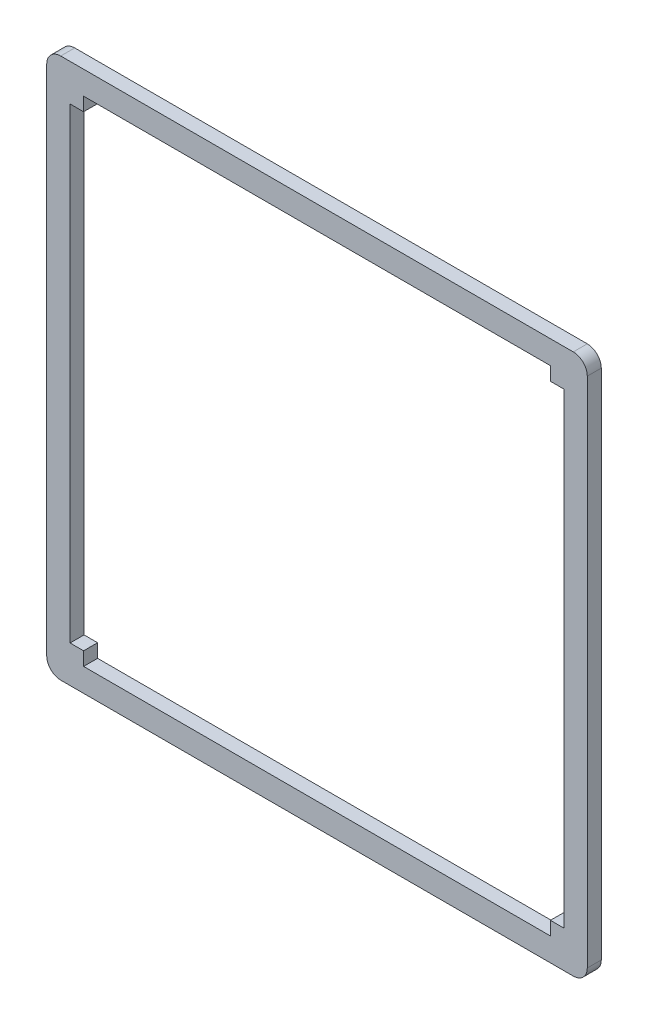
ISO-10303-21;
HEADER;
FILE_DESCRIPTION(('STEP AP214'),'2;1');
FILE_NAME('part.step','',(''),(''),'','','');
FILE_SCHEMA(('AUTOMOTIVE_DESIGN { 1 0 10303 214 1 1 1 1 }'));
ENDSEC;
DATA;
#1=APPLICATION_CONTEXT('core data for automotive mechanical design processes');
#2=APPLICATION_PROTOCOL_DEFINITION('international standard','automotive_design',2000,#1);
#3=PRODUCT_CONTEXT('',#1,'mechanical');
#4=PRODUCT('Part','Part','',(#3));
#5=PRODUCT_RELATED_PRODUCT_CATEGORY('part','',(#4));
#6=PRODUCT_DEFINITION_FORMATION('','',#4);
#7=PRODUCT_DEFINITION_CONTEXT('part definition',#1,'design');
#8=PRODUCT_DEFINITION('design','',#6,#7);
#9=PRODUCT_DEFINITION_SHAPE('','',#8);
#10=(LENGTH_UNIT() NAMED_UNIT(*) SI_UNIT(.MILLI.,.METRE.));
#11=(NAMED_UNIT(*) PLANE_ANGLE_UNIT() SI_UNIT($,.RADIAN.));
#12=(NAMED_UNIT(*) SI_UNIT($,.STERADIAN.) SOLID_ANGLE_UNIT());
#13=UNCERTAINTY_MEASURE_WITH_UNIT(LENGTH_MEASURE(1.E-05),#10,'distance_accuracy_value','');
#14=(GEOMETRIC_REPRESENTATION_CONTEXT(3) GLOBAL_UNCERTAINTY_ASSIGNED_CONTEXT((#13)) GLOBAL_UNIT_ASSIGNED_CONTEXT((#10,
#11,#12)) REPRESENTATION_CONTEXT('',''));
#15=CARTESIAN_POINT('',(0.,0.,0.));
#16=DIRECTION('',(0.,0.,1.));
#17=DIRECTION('',(1.,0.,0.));
#18=AXIS2_PLACEMENT_3D('',#15,#16,#17);
#19=CARTESIAN_POINT('',(107.9,0.,3.));
#20=DIRECTION('',(1.,0.,0.));
#21=DIRECTION('',(0.,0.,-1.));
#22=AXIS2_PLACEMENT_3D('',#19,#20,#21);
#23=PLANE('',#22);
#24=DIRECTION('',(0.,-1.,0.));
#25=VECTOR('',#24,1.);
#26=CARTESIAN_POINT('',(107.9,0.,0.));
#27=LINE('',#26,#25);
#28=CARTESIAN_POINT('',(107.9,104.9,0.));
#29=VERTEX_POINT('',#28);
#30=CARTESIAN_POINT('',(107.9,-4.9,0.));
#31=VERTEX_POINT('',#30);
#32=EDGE_CURVE('E240',#29,#31,#27,.T.);
#33=ORIENTED_EDGE('',*,*,#32,.F.);
#34=DIRECTION('',(0.,0.,-1.));
#35=VECTOR('',#34,1.);
#36=CARTESIAN_POINT('',(107.9,104.9,3.));
#37=LINE('',#36,#35);
#38=CARTESIAN_POINT('',(107.9,104.9,3.));
#39=VERTEX_POINT('',#38);
#40=EDGE_CURVE('E11',#39,#29,#37,.T.);
#41=ORIENTED_EDGE('',*,*,#40,.F.);
#42=DIRECTION('',(0.,-1.,0.));
#43=VECTOR('',#42,1.);
#44=CARTESIAN_POINT('',(107.9,0.,3.));
#45=LINE('',#44,#43);
#46=CARTESIAN_POINT('',(107.9,-4.9,3.));
#47=VERTEX_POINT('',#46);
#48=EDGE_CURVE('E473',#39,#47,#45,.T.);
#49=ORIENTED_EDGE('',*,*,#48,.T.);
#50=DIRECTION('',(0.,0.,-1.));
#51=VECTOR('',#50,1.);
#52=CARTESIAN_POINT('',(107.9,-4.9,3.));
#53=LINE('',#52,#51);
#54=EDGE_CURVE('E121',#47,#31,#53,.T.);
#55=ORIENTED_EDGE('',*,*,#54,.T.);
#56=EDGE_LOOP('',(#33,#41,#49,#55));
#57=FACE_BOUND('',#56,.T.);
#58=ADVANCED_FACE('F31',(#57),#23,.T.);
#59=CARTESIAN_POINT('',(104.9,104.9,3.));
#60=DIRECTION('',(0.,0.,-1.));
#61=DIRECTION('',(-1.,0.,0.));
#62=AXIS2_PLACEMENT_3D('',#59,#60,#61);
#63=CYLINDRICAL_SURFACE('',#62,3.00000000000001);
#64=CARTESIAN_POINT('',(104.9,104.9,0.));
#65=DIRECTION('',(0.,0.,1.));
#66=DIRECTION('',(1.,0.,0.));
#67=AXIS2_PLACEMENT_3D('',#64,#65,#66);
#68=CIRCLE('',#67,3.00000000000001);
#69=CARTESIAN_POINT('',(104.9,107.9,0.));
#70=VERTEX_POINT('',#69);
#71=EDGE_CURVE('E242',#29,#70,#68,.T.);
#72=ORIENTED_EDGE('',*,*,#71,.T.);
#73=DIRECTION('',(0.,0.,-1.));
#74=VECTOR('',#73,1.);
#75=CARTESIAN_POINT('',(104.9,107.9,3.));
#76=LINE('',#75,#74);
#77=CARTESIAN_POINT('',(104.9,107.9,3.));
#78=VERTEX_POINT('',#77);
#79=EDGE_CURVE('E41',#78,#70,#76,.T.);
#80=ORIENTED_EDGE('',*,*,#79,.F.);
#81=CARTESIAN_POINT('',(104.9,104.9,3.));
#82=DIRECTION('',(0.,0.,1.));
#83=DIRECTION('',(1.,0.,0.));
#84=AXIS2_PLACEMENT_3D('',#81,#82,#83);
#85=CIRCLE('',#84,3.00000000000001);
#86=EDGE_CURVE('E469',#39,#78,#85,.T.);
#87=ORIENTED_EDGE('',*,*,#86,.F.);
#88=ORIENTED_EDGE('',*,*,#40,.T.);
#89=EDGE_LOOP('',(#72,#80,#87,#88));
#90=FACE_BOUND('',#89,.T.);
#91=ADVANCED_FACE('F357',(#90),#63,.T.);
#92=CARTESIAN_POINT('',(0.,107.9,3.));
#93=DIRECTION('',(0.,1.,0.));
#94=DIRECTION('',(0.,0.,1.));
#95=AXIS2_PLACEMENT_3D('',#92,#93,#94);
#96=PLANE('',#95);
#97=DIRECTION('',(1.,0.,0.));
#98=VECTOR('',#97,1.);
#99=CARTESIAN_POINT('',(0.,107.9,0.));
#100=LINE('',#99,#98);
#101=CARTESIAN_POINT('',(-4.90000000000003,107.9,0.));
#102=VERTEX_POINT('',#101);
#103=EDGE_CURVE('E245',#102,#70,#100,.T.);
#104=ORIENTED_EDGE('',*,*,#103,.F.);
#105=DIRECTION('',(0.,0.,-1.));
#106=VECTOR('',#105,1.);
#107=CARTESIAN_POINT('',(-4.90000000000003,107.9,3.));
#108=LINE('',#107,#106);
#109=CARTESIAN_POINT('',(-4.90000000000003,107.9,3.));
#110=VERTEX_POINT('',#109);
#111=EDGE_CURVE('E264',#110,#102,#108,.T.);
#112=ORIENTED_EDGE('',*,*,#111,.F.);
#113=DIRECTION('',(1.,0.,0.));
#114=VECTOR('',#113,1.);
#115=CARTESIAN_POINT('',(0.,107.9,3.));
#116=LINE('',#115,#114);
#117=EDGE_CURVE('E468',#110,#78,#116,.T.);
#118=ORIENTED_EDGE('',*,*,#117,.T.);
#119=ORIENTED_EDGE('',*,*,#79,.T.);
#120=EDGE_LOOP('',(#104,#112,#118,#119));
#121=FACE_BOUND('',#120,.T.);
#122=ADVANCED_FACE('F362',(#121),#96,.T.);
#123=CARTESIAN_POINT('',(-4.90000000000002,104.9,3.));
#124=DIRECTION('',(0.,0.,-1.));
#125=DIRECTION('',(-1.,0.,0.));
#126=AXIS2_PLACEMENT_3D('',#123,#124,#125);
#127=CYLINDRICAL_SURFACE('',#126,3.);
#128=CARTESIAN_POINT('',(-4.90000000000002,104.9,0.));
#129=DIRECTION('',(0.,0.,1.));
#130=DIRECTION('',(1.,0.,0.));
#131=AXIS2_PLACEMENT_3D('',#128,#129,#130);
#132=CIRCLE('',#131,3.);
#133=CARTESIAN_POINT('',(-7.90000000000002,104.9,0.));
#134=VERTEX_POINT('',#133);
#135=EDGE_CURVE('E248',#134,#102,#132,.F.);
#136=ORIENTED_EDGE('',*,*,#135,.F.);
#137=DIRECTION('',(0.,0.,-1.));
#138=VECTOR('',#137,1.);
#139=CARTESIAN_POINT('',(-7.90000000000002,104.9,3.));
#140=LINE('',#139,#138);
#141=CARTESIAN_POINT('',(-7.90000000000002,104.9,3.));
#142=VERTEX_POINT('',#141);
#143=EDGE_CURVE('E262',#142,#134,#140,.T.);
#144=ORIENTED_EDGE('',*,*,#143,.F.);
#145=CARTESIAN_POINT('',(-4.90000000000002,104.9,3.));
#146=DIRECTION('',(0.,0.,1.));
#147=DIRECTION('',(1.,0.,0.));
#148=AXIS2_PLACEMENT_3D('',#145,#146,#147);
#149=CIRCLE('',#148,3.);
#150=EDGE_CURVE('E202',#142,#110,#149,.F.);
#151=ORIENTED_EDGE('',*,*,#150,.T.);
#152=ORIENTED_EDGE('',*,*,#111,.T.);
#153=EDGE_LOOP('',(#136,#144,#151,#152));
#154=FACE_BOUND('',#153,.T.);
#155=ADVANCED_FACE('F452',(#154),#127,.T.);
#156=CARTESIAN_POINT('',(-7.9,0.,3.));
#157=DIRECTION('',(1.,0.,0.));
#158=DIRECTION('',(0.,1.,0.));
#159=AXIS2_PLACEMENT_3D('',#156,#157,#158);
#160=PLANE('',#159);
#161=DIRECTION('',(0.,-1.,0.));
#162=VECTOR('',#161,1.);
#163=CARTESIAN_POINT('',(-7.9,0.,0.));
#164=LINE('',#163,#162);
#165=CARTESIAN_POINT('',(-7.9,-4.9,0.));
#166=VERTEX_POINT('',#165);
#167=EDGE_CURVE('E251',#134,#166,#164,.T.);
#168=ORIENTED_EDGE('',*,*,#167,.T.);
#169=DIRECTION('',(0.,0.,-1.));
#170=VECTOR('',#169,1.);
#171=CARTESIAN_POINT('',(-7.9,-4.9,3.));
#172=LINE('',#171,#170);
#173=CARTESIAN_POINT('',(-7.9,-4.9,3.));
#174=VERTEX_POINT('',#173);
#175=EDGE_CURVE('E189',#174,#166,#172,.T.);
#176=ORIENTED_EDGE('',*,*,#175,.F.);
#177=DIRECTION('',(0.,-1.,0.));
#178=VECTOR('',#177,1.);
#179=CARTESIAN_POINT('',(-7.9,0.,3.));
#180=LINE('',#179,#178);
#181=EDGE_CURVE('E199',#142,#174,#180,.T.);
#182=ORIENTED_EDGE('',*,*,#181,.F.);
#183=ORIENTED_EDGE('',*,*,#143,.T.);
#184=EDGE_LOOP('',(#168,#176,#182,#183));
#185=FACE_BOUND('',#184,.T.);
#186=ADVANCED_FACE('F449',(#185),#160,.F.);
#187=CARTESIAN_POINT('',(-4.9,-4.9,3.));
#188=DIRECTION('',(0.,0.,-1.));
#189=DIRECTION('',(-1.,0.,0.));
#190=AXIS2_PLACEMENT_3D('',#187,#188,#189);
#191=CYLINDRICAL_SURFACE('',#190,2.99999999999999);
#192=CARTESIAN_POINT('',(-4.9,-4.9,0.));
#193=DIRECTION('',(0.,0.,1.));
#194=DIRECTION('',(1.,0.,0.));
#195=AXIS2_PLACEMENT_3D('',#192,#193,#194);
#196=CIRCLE('',#195,2.99999999999999);
#197=CARTESIAN_POINT('',(-4.90000000000006,-7.89999999999999,0.));
#198=VERTEX_POINT('',#197);
#199=EDGE_CURVE('E186',#198,#166,#196,.F.);
#200=ORIENTED_EDGE('',*,*,#199,.F.);
#201=DIRECTION('',(0.,0.,-1.));
#202=VECTOR('',#201,1.);
#203=CARTESIAN_POINT('',(-4.90000000000006,-7.89999999999999,3.));
#204=LINE('',#203,#202);
#205=CARTESIAN_POINT('',(-4.90000000000006,-7.89999999999999,3.));
#206=VERTEX_POINT('',#205);
#207=EDGE_CURVE('E180',#206,#198,#204,.T.);
#208=ORIENTED_EDGE('',*,*,#207,.F.);
#209=CARTESIAN_POINT('',(-4.9,-4.9,3.));
#210=DIRECTION('',(0.,0.,1.));
#211=DIRECTION('',(1.,0.,0.));
#212=AXIS2_PLACEMENT_3D('',#209,#210,#211);
#213=CIRCLE('',#212,2.99999999999999);
#214=EDGE_CURVE('E184',#206,#174,#213,.F.);
#215=ORIENTED_EDGE('',*,*,#214,.T.);
#216=ORIENTED_EDGE('',*,*,#175,.T.);
#217=EDGE_LOOP('',(#200,#208,#215,#216));
#218=FACE_BOUND('',#217,.T.);
#219=ADVANCED_FACE('F182',(#218),#191,.T.);
#220=CARTESIAN_POINT('',(0.,-7.89999999999999,3.));
#221=DIRECTION('',(0.,1.,0.));
#222=DIRECTION('',(-1.,0.,0.));
#223=AXIS2_PLACEMENT_3D('',#220,#221,#222);
#224=PLANE('',#223);
#225=DIRECTION('',(1.,0.,0.));
#226=VECTOR('',#225,1.);
#227=CARTESIAN_POINT('',(0.,-7.89999999999999,0.));
#228=LINE('',#227,#226);
#229=CARTESIAN_POINT('',(104.9,-7.9,0.));
#230=VERTEX_POINT('',#229);
#231=EDGE_CURVE('E255',#198,#230,#228,.T.);
#232=ORIENTED_EDGE('',*,*,#231,.T.);
#233=DIRECTION('',(0.,0.,-1.));
#234=VECTOR('',#233,1.);
#235=CARTESIAN_POINT('',(104.9,-7.9,3.));
#236=LINE('',#235,#234);
#237=CARTESIAN_POINT('',(104.9,-7.9,3.));
#238=VERTEX_POINT('',#237);
#239=EDGE_CURVE('E190',#238,#230,#236,.T.);
#240=ORIENTED_EDGE('',*,*,#239,.F.);
#241=DIRECTION('',(1.,0.,0.));
#242=VECTOR('',#241,1.);
#243=CARTESIAN_POINT('',(0.,-7.89999999999999,3.));
#244=LINE('',#243,#242);
#245=EDGE_CURVE('E193',#206,#238,#244,.T.);
#246=ORIENTED_EDGE('',*,*,#245,.F.);
#247=ORIENTED_EDGE('',*,*,#207,.T.);
#248=EDGE_LOOP('',(#232,#240,#246,#247));
#249=FACE_BOUND('',#248,.T.);
#250=ADVANCED_FACE('F194',(#249),#224,.F.);
#251=CARTESIAN_POINT('',(0.,0.,3.));
#252=DIRECTION('',(1.,0.,0.));
#253=DIRECTION('',(0.,0.,-1.));
#254=AXIS2_PLACEMENT_3D('',#251,#252,#253);
#255=PLANE('',#254);
#256=DIRECTION('',(0.,-1.,0.));
#257=VECTOR('',#256,1.);
#258=CARTESIAN_POINT('',(0.,0.,0.));
#259=LINE('',#258,#257);
#260=CARTESIAN_POINT('',(0.,102.9,0.));
#261=VERTEX_POINT('',#260);
#262=CARTESIAN_POINT('',(0.,100.,0.));
#263=VERTEX_POINT('',#262);
#264=EDGE_CURVE('E208',#261,#263,#259,.T.);
#265=ORIENTED_EDGE('',*,*,#264,.F.);
#266=DIRECTION('',(0.,0.,-1.));
#267=VECTOR('',#266,1.);
#268=CARTESIAN_POINT('',(0.,102.9,3.));
#269=LINE('',#268,#267);
#270=CARTESIAN_POINT('',(0.,102.9,3.));
#271=VERTEX_POINT('',#270);
#272=EDGE_CURVE('E35',#271,#261,#269,.T.);
#273=ORIENTED_EDGE('',*,*,#272,.F.);
#274=DIRECTION('',(0.,-1.,0.));
#275=VECTOR('',#274,1.);
#276=CARTESIAN_POINT('',(0.,0.,3.));
#277=LINE('',#276,#275);
#278=CARTESIAN_POINT('',(0.,100.,3.));
#279=VERTEX_POINT('',#278);
#280=EDGE_CURVE('E258',#271,#279,#277,.T.);
#281=ORIENTED_EDGE('',*,*,#280,.T.);
#282=DIRECTION('',(0.,0.,-1.));
#283=VECTOR('',#282,1.);
#284=CARTESIAN_POINT('',(0.,100.,3.));
#285=LINE('',#284,#283);
#286=EDGE_CURVE('E207',#279,#263,#285,.T.);
#287=ORIENTED_EDGE('',*,*,#286,.T.);
#288=EDGE_LOOP('',(#265,#273,#281,#287));
#289=FACE_BOUND('',#288,.T.);
#290=ADVANCED_FACE('F33',(#289),#255,.T.);
#291=CARTESIAN_POINT('',(0.,102.9,3.));
#292=DIRECTION('',(0.,1.,0.));
#293=DIRECTION('',(0.,0.,1.));
#294=AXIS2_PLACEMENT_3D('',#291,#292,#293);
#295=PLANE('',#294);
#296=DIRECTION('',(1.,0.,0.));
#297=VECTOR('',#296,1.);
#298=CARTESIAN_POINT('',(0.,102.9,0.));
#299=LINE('',#298,#297);
#300=CARTESIAN_POINT('',(100.,102.9,0.));
#301=VERTEX_POINT('',#300);
#302=EDGE_CURVE('E211',#261,#301,#299,.T.);
#303=ORIENTED_EDGE('',*,*,#302,.T.);
#304=DIRECTION('',(0.,0.,-1.));
#305=VECTOR('',#304,1.);
#306=CARTESIAN_POINT('',(100.,102.9,3.));
#307=LINE('',#306,#305);
#308=CARTESIAN_POINT('',(100.,102.9,3.));
#309=VERTEX_POINT('',#308);
#310=EDGE_CURVE('E288',#309,#301,#307,.T.);
#311=ORIENTED_EDGE('',*,*,#310,.F.);
#312=DIRECTION('',(1.,0.,0.));
#313=VECTOR('',#312,1.);
#314=CARTESIAN_POINT('',(0.,102.9,3.));
#315=LINE('',#314,#313);
#316=EDGE_CURVE('E297',#271,#309,#315,.T.);
#317=ORIENTED_EDGE('',*,*,#316,.F.);
#318=ORIENTED_EDGE('',*,*,#272,.T.);
#319=EDGE_LOOP('',(#303,#311,#317,#318));
#320=FACE_BOUND('',#319,.T.);
#321=ADVANCED_FACE('F296',(#320),#295,.F.);
#322=CARTESIAN_POINT('',(100.,0.,3.));
#323=DIRECTION('',(1.,0.,0.));
#324=DIRECTION('',(0.,0.,-1.));
#325=AXIS2_PLACEMENT_3D('',#322,#323,#324);
#326=PLANE('',#325);
#327=DIRECTION('',(0.,-1.,0.));
#328=VECTOR('',#327,1.);
#329=CARTESIAN_POINT('',(100.,0.,0.));
#330=LINE('',#329,#328);
#331=CARTESIAN_POINT('',(100.,100.,0.));
#332=VERTEX_POINT('',#331);
#333=EDGE_CURVE('E213',#301,#332,#330,.T.);
#334=ORIENTED_EDGE('',*,*,#333,.T.);
#335=DIRECTION('',(0.,0.,-1.));
#336=VECTOR('',#335,1.);
#337=CARTESIAN_POINT('',(100.,100.,3.));
#338=LINE('',#337,#336);
#339=CARTESIAN_POINT('',(100.,100.,3.));
#340=VERTEX_POINT('',#339);
#341=EDGE_CURVE('E287',#340,#332,#338,.T.);
#342=ORIENTED_EDGE('',*,*,#341,.F.);
#343=DIRECTION('',(0.,-1.,0.));
#344=VECTOR('',#343,1.);
#345=CARTESIAN_POINT('',(100.,0.,3.));
#346=LINE('',#345,#344);
#347=EDGE_CURVE('E490',#309,#340,#346,.T.);
#348=ORIENTED_EDGE('',*,*,#347,.F.);
#349=ORIENTED_EDGE('',*,*,#310,.T.);
#350=EDGE_LOOP('',(#334,#342,#348,#349));
#351=FACE_BOUND('',#350,.T.);
#352=ADVANCED_FACE('F347',(#351),#326,.F.);
#353=CARTESIAN_POINT('',(0.,100.,3.));
#354=DIRECTION('',(0.,-1.,0.));
#355=DIRECTION('',(0.,0.,-1.));
#356=AXIS2_PLACEMENT_3D('',#353,#354,#355);
#357=PLANE('',#356);
#358=DIRECTION('',(-1.,0.,0.));
#359=VECTOR('',#358,1.);
#360=CARTESIAN_POINT('',(0.,100.,0.));
#361=LINE('',#360,#359);
#362=CARTESIAN_POINT('',(102.9,100.,0.));
#363=VERTEX_POINT('',#362);
#364=EDGE_CURVE('E216',#363,#332,#361,.T.);
#365=ORIENTED_EDGE('',*,*,#364,.F.);
#366=DIRECTION('',(0.,0.,-1.));
#367=VECTOR('',#366,1.);
#368=CARTESIAN_POINT('',(102.9,100.,3.));
#369=LINE('',#368,#367);
#370=CARTESIAN_POINT('',(102.9,100.,3.));
#371=VERTEX_POINT('',#370);
#372=EDGE_CURVE('E285',#371,#363,#369,.T.);
#373=ORIENTED_EDGE('',*,*,#372,.F.);
#374=DIRECTION('',(-1.,0.,0.));
#375=VECTOR('',#374,1.);
#376=CARTESIAN_POINT('',(0.,100.,3.));
#377=LINE('',#376,#375);
#378=EDGE_CURVE('E346',#371,#340,#377,.T.);
#379=ORIENTED_EDGE('',*,*,#378,.T.);
#380=ORIENTED_EDGE('',*,*,#341,.T.);
#381=EDGE_LOOP('',(#365,#373,#379,#380));
#382=FACE_BOUND('',#381,.T.);
#383=ADVANCED_FACE('F341',(#382),#357,.T.);
#384=CARTESIAN_POINT('',(102.9,0.,3.));
#385=DIRECTION('',(1.,0.,0.));
#386=DIRECTION('',(0.,0.,-1.));
#387=AXIS2_PLACEMENT_3D('',#384,#385,#386);
#388=PLANE('',#387);
#389=DIRECTION('',(0.,-1.,0.));
#390=VECTOR('',#389,1.);
#391=CARTESIAN_POINT('',(102.9,0.,0.));
#392=LINE('',#391,#390);
#393=CARTESIAN_POINT('',(102.9,0.,0.));
#394=VERTEX_POINT('',#393);
#395=EDGE_CURVE('E219',#363,#394,#392,.T.);
#396=ORIENTED_EDGE('',*,*,#395,.T.);
#397=DIRECTION('',(0.,0.,-1.));
#398=VECTOR('',#397,1.);
#399=CARTESIAN_POINT('',(102.9,0.,3.));
#400=LINE('',#399,#398);
#401=CARTESIAN_POINT('',(102.9,0.,3.));
#402=VERTEX_POINT('',#401);
#403=EDGE_CURVE('E282',#402,#394,#400,.T.);
#404=ORIENTED_EDGE('',*,*,#403,.F.);
#405=DIRECTION('',(0.,-1.,0.));
#406=VECTOR('',#405,1.);
#407=CARTESIAN_POINT('',(102.9,0.,3.));
#408=LINE('',#407,#406);
#409=EDGE_CURVE('E487',#371,#402,#408,.T.);
#410=ORIENTED_EDGE('',*,*,#409,.F.);
#411=ORIENTED_EDGE('',*,*,#372,.T.);
#412=EDGE_LOOP('',(#396,#404,#410,#411));
#413=FACE_BOUND('',#412,.T.);
#414=ADVANCED_FACE('F354',(#413),#388,.F.);
#415=CARTESIAN_POINT('',(0.,0.,3.));
#416=DIRECTION('',(0.,-1.,0.));
#417=DIRECTION('',(0.,0.,-1.));
#418=AXIS2_PLACEMENT_3D('',#415,#416,#417);
#419=PLANE('',#418);
#420=DIRECTION('',(-1.,0.,0.));
#421=VECTOR('',#420,1.);
#422=CARTESIAN_POINT('',(0.,0.,0.));
#423=LINE('',#422,#421);
#424=CARTESIAN_POINT('',(100.,0.,0.));
#425=VERTEX_POINT('',#424);
#426=EDGE_CURVE('E221',#394,#425,#423,.T.);
#427=ORIENTED_EDGE('',*,*,#426,.T.);
#428=DIRECTION('',(0.,0.,-1.));
#429=VECTOR('',#428,1.);
#430=CARTESIAN_POINT('',(100.,0.,3.));
#431=LINE('',#430,#429);
#432=CARTESIAN_POINT('',(100.,0.,3.));
#433=VERTEX_POINT('',#432);
#434=EDGE_CURVE('E280',#433,#425,#431,.T.);
#435=ORIENTED_EDGE('',*,*,#434,.F.);
#436=DIRECTION('',(-1.,0.,0.));
#437=VECTOR('',#436,1.);
#438=CARTESIAN_POINT('',(0.,0.,3.));
#439=LINE('',#438,#437);
#440=EDGE_CURVE('E485',#402,#433,#439,.T.);
#441=ORIENTED_EDGE('',*,*,#440,.F.);
#442=ORIENTED_EDGE('',*,*,#403,.T.);
#443=EDGE_LOOP('',(#427,#435,#441,#442));
#444=FACE_BOUND('',#443,.T.);
#445=ADVANCED_FACE('F335',(#444),#419,.F.);
#446=CARTESIAN_POINT('',(100.,0.,3.));
#447=DIRECTION('',(-1.,0.,0.));
#448=DIRECTION('',(0.,0.,1.));
#449=AXIS2_PLACEMENT_3D('',#446,#447,#448);
#450=PLANE('',#449);
#451=DIRECTION('',(0.,1.,0.));
#452=VECTOR('',#451,1.);
#453=CARTESIAN_POINT('',(100.,0.,0.));
#454=LINE('',#453,#452);
#455=CARTESIAN_POINT('',(100.,-2.90000000000003,0.));
#456=VERTEX_POINT('',#455);
#457=EDGE_CURVE('E224',#456,#425,#454,.T.);
#458=ORIENTED_EDGE('',*,*,#457,.F.);
#459=DIRECTION('',(0.,0.,-1.));
#460=VECTOR('',#459,1.);
#461=CARTESIAN_POINT('',(100.,-2.90000000000003,3.));
#462=LINE('',#461,#460);
#463=CARTESIAN_POINT('',(100.,-2.90000000000003,3.));
#464=VERTEX_POINT('',#463);
#465=EDGE_CURVE('E278',#464,#456,#462,.T.);
#466=ORIENTED_EDGE('',*,*,#465,.F.);
#467=DIRECTION('',(0.,1.,0.));
#468=VECTOR('',#467,1.);
#469=CARTESIAN_POINT('',(100.,0.,3.));
#470=LINE('',#469,#468);
#471=EDGE_CURVE('E332',#464,#433,#470,.T.);
#472=ORIENTED_EDGE('',*,*,#471,.T.);
#473=ORIENTED_EDGE('',*,*,#434,.T.);
#474=EDGE_LOOP('',(#458,#466,#472,#473));
#475=FACE_BOUND('',#474,.T.);
#476=ADVANCED_FACE('F327',(#475),#450,.T.);
#477=CARTESIAN_POINT('',(0.,-2.90000000000004,3.));
#478=DIRECTION('',(0.,-1.,0.));
#479=DIRECTION('',(1.,0.,0.));
#480=AXIS2_PLACEMENT_3D('',#477,#478,#479);
#481=PLANE('',#480);
#482=DIRECTION('',(-1.,0.,0.));
#483=VECTOR('',#482,1.);
#484=CARTESIAN_POINT('',(0.,-2.90000000000004,0.));
#485=LINE('',#484,#483);
#486=CARTESIAN_POINT('',(0.,-2.90000000000004,0.));
#487=VERTEX_POINT('',#486);
#488=EDGE_CURVE('E227',#456,#487,#485,.T.);
#489=ORIENTED_EDGE('',*,*,#488,.T.);
#490=DIRECTION('',(0.,0.,-1.));
#491=VECTOR('',#490,1.);
#492=CARTESIAN_POINT('',(0.,-2.90000000000004,3.));
#493=LINE('',#492,#491);
#494=CARTESIAN_POINT('',(0.,-2.90000000000004,3.));
#495=VERTEX_POINT('',#494);
#496=EDGE_CURVE('E275',#495,#487,#493,.T.);
#497=ORIENTED_EDGE('',*,*,#496,.F.);
#498=DIRECTION('',(-1.,0.,0.));
#499=VECTOR('',#498,1.);
#500=CARTESIAN_POINT('',(0.,-2.90000000000004,3.));
#501=LINE('',#500,#499);
#502=EDGE_CURVE('E482',#464,#495,#501,.T.);
#503=ORIENTED_EDGE('',*,*,#502,.F.);
#504=ORIENTED_EDGE('',*,*,#465,.T.);
#505=EDGE_LOOP('',(#489,#497,#503,#504));
#506=FACE_BOUND('',#505,.T.);
#507=ADVANCED_FACE('F377',(#506),#481,.F.);
#508=CARTESIAN_POINT('',(0.,0.,3.));
#509=DIRECTION('',(-1.,0.,0.));
#510=DIRECTION('',(0.,0.,1.));
#511=AXIS2_PLACEMENT_3D('',#508,#509,#510);
#512=PLANE('',#511);
#513=DIRECTION('',(0.,1.,0.));
#514=VECTOR('',#513,1.);
#515=CARTESIAN_POINT('',(0.,0.,0.));
#516=LINE('',#515,#514);
#517=CARTESIAN_POINT('',(0.,0.,0.));
#518=VERTEX_POINT('',#517);
#519=EDGE_CURVE('E229',#487,#518,#516,.T.);
#520=ORIENTED_EDGE('',*,*,#519,.T.);
#521=DIRECTION('',(0.,0.,-1.));
#522=VECTOR('',#521,1.);
#523=CARTESIAN_POINT('',(0.,0.,3.));
#524=LINE('',#523,#522);
#525=CARTESIAN_POINT('',(0.,0.,3.));
#526=VERTEX_POINT('',#525);
#527=EDGE_CURVE('E273',#526,#518,#524,.T.);
#528=ORIENTED_EDGE('',*,*,#527,.F.);
#529=DIRECTION('',(0.,1.,0.));
#530=VECTOR('',#529,1.);
#531=CARTESIAN_POINT('',(0.,0.,3.));
#532=LINE('',#531,#530);
#533=EDGE_CURVE('E480',#495,#526,#532,.T.);
#534=ORIENTED_EDGE('',*,*,#533,.F.);
#535=ORIENTED_EDGE('',*,*,#496,.T.);
#536=EDGE_LOOP('',(#520,#528,#534,#535));
#537=FACE_BOUND('',#536,.T.);
#538=ADVANCED_FACE('F320',(#537),#512,.F.);
#539=CARTESIAN_POINT('',(0.,0.,3.));
#540=DIRECTION('',(0.,1.,0.));
#541=DIRECTION('',(0.,0.,1.));
#542=AXIS2_PLACEMENT_3D('',#539,#540,#541);
#543=PLANE('',#542);
#544=DIRECTION('',(1.,0.,0.));
#545=VECTOR('',#544,1.);
#546=CARTESIAN_POINT('',(0.,0.,0.));
#547=LINE('',#546,#545);
#548=CARTESIAN_POINT('',(-2.9,0.,0.));
#549=VERTEX_POINT('',#548);
#550=EDGE_CURVE('E232',#549,#518,#547,.T.);
#551=ORIENTED_EDGE('',*,*,#550,.F.);
#552=DIRECTION('',(0.,0.,-1.));
#553=VECTOR('',#552,1.);
#554=CARTESIAN_POINT('',(-2.9,0.,3.));
#555=LINE('',#554,#553);
#556=CARTESIAN_POINT('',(-2.9,0.,3.));
#557=VERTEX_POINT('',#556);
#558=EDGE_CURVE('E271',#557,#549,#555,.T.);
#559=ORIENTED_EDGE('',*,*,#558,.F.);
#560=DIRECTION('',(1.,0.,0.));
#561=VECTOR('',#560,1.);
#562=CARTESIAN_POINT('',(0.,0.,3.));
#563=LINE('',#562,#561);
#564=EDGE_CURVE('E317',#557,#526,#563,.T.);
#565=ORIENTED_EDGE('',*,*,#564,.T.);
#566=ORIENTED_EDGE('',*,*,#527,.T.);
#567=EDGE_LOOP('',(#551,#559,#565,#566));
#568=FACE_BOUND('',#567,.T.);
#569=ADVANCED_FACE('F312',(#568),#543,.T.);
#570=CARTESIAN_POINT('',(-2.9,0.,3.));
#571=DIRECTION('',(-1.,0.,0.));
#572=DIRECTION('',(0.,0.,1.));
#573=AXIS2_PLACEMENT_3D('',#570,#571,#572);
#574=PLANE('',#573);
#575=DIRECTION('',(0.,1.,0.));
#576=VECTOR('',#575,1.);
#577=CARTESIAN_POINT('',(-2.9,0.,0.));
#578=LINE('',#577,#576);
#579=CARTESIAN_POINT('',(-2.9,100.,0.));
#580=VERTEX_POINT('',#579);
#581=EDGE_CURVE('E235',#549,#580,#578,.T.);
#582=ORIENTED_EDGE('',*,*,#581,.T.);
#583=DIRECTION('',(0.,0.,-1.));
#584=VECTOR('',#583,1.);
#585=CARTESIAN_POINT('',(-2.9,100.,3.));
#586=LINE('',#585,#584);
#587=CARTESIAN_POINT('',(-2.9,100.,3.));
#588=VERTEX_POINT('',#587);
#589=EDGE_CURVE('E268',#588,#580,#586,.T.);
#590=ORIENTED_EDGE('',*,*,#589,.F.);
#591=DIRECTION('',(0.,1.,0.));
#592=VECTOR('',#591,1.);
#593=CARTESIAN_POINT('',(-2.9,0.,3.));
#594=LINE('',#593,#592);
#595=EDGE_CURVE('E477',#557,#588,#594,.T.);
#596=ORIENTED_EDGE('',*,*,#595,.F.);
#597=ORIENTED_EDGE('',*,*,#558,.T.);
#598=EDGE_LOOP('',(#582,#590,#596,#597));
#599=FACE_BOUND('',#598,.T.);
#600=ADVANCED_FACE('F370',(#599),#574,.F.);
#601=CARTESIAN_POINT('',(0.,100.,3.));
#602=DIRECTION('',(0.,1.,0.));
#603=DIRECTION('',(0.,0.,1.));
#604=AXIS2_PLACEMENT_3D('',#601,#602,#603);
#605=PLANE('',#604);
#606=DIRECTION('',(1.,0.,0.));
#607=VECTOR('',#606,1.);
#608=CARTESIAN_POINT('',(0.,100.,0.));
#609=LINE('',#608,#607);
#610=EDGE_CURVE('E237',#580,#263,#609,.T.);
#611=ORIENTED_EDGE('',*,*,#610,.T.);
#612=ORIENTED_EDGE('',*,*,#286,.F.);
#613=DIRECTION('',(1.,0.,0.));
#614=VECTOR('',#613,1.);
#615=CARTESIAN_POINT('',(0.,100.,3.));
#616=LINE('',#615,#614);
#617=EDGE_CURVE('E475',#588,#279,#616,.T.);
#618=ORIENTED_EDGE('',*,*,#617,.F.);
#619=ORIENTED_EDGE('',*,*,#589,.T.);
#620=EDGE_LOOP('',(#611,#612,#618,#619));
#621=FACE_BOUND('',#620,.T.);
#622=ADVANCED_FACE('F305',(#621),#605,.F.);
#623=CARTESIAN_POINT('',(104.9,-4.9,3.));
#624=DIRECTION('',(0.,0.,-1.));
#625=DIRECTION('',(-1.,0.,0.));
#626=AXIS2_PLACEMENT_3D('',#623,#624,#625);
#627=CYLINDRICAL_SURFACE('',#626,3.);
#628=CARTESIAN_POINT('',(104.9,-4.9,0.));
#629=DIRECTION('',(0.,0.,1.));
#630=DIRECTION('',(1.,0.,0.));
#631=AXIS2_PLACEMENT_3D('',#628,#629,#630);
#632=CIRCLE('',#631,3.);
#633=EDGE_CURVE('E114',#230,#31,#632,.T.);
#634=ORIENTED_EDGE('',*,*,#633,.T.);
#635=ORIENTED_EDGE('',*,*,#54,.F.);
#636=CARTESIAN_POINT('',(104.9,-4.9,3.));
#637=DIRECTION('',(0.,0.,1.));
#638=DIRECTION('',(1.,0.,0.));
#639=AXIS2_PLACEMENT_3D('',#636,#637,#638);
#640=CIRCLE('',#639,3.);
#641=EDGE_CURVE('E50',#238,#47,#640,.T.);
#642=ORIENTED_EDGE('',*,*,#641,.F.);
#643=ORIENTED_EDGE('',*,*,#239,.T.);
#644=EDGE_LOOP('',(#634,#635,#642,#643));
#645=FACE_BOUND('',#644,.T.);
#646=ADVANCED_FACE('F369',(#645),#627,.T.);
#647=CARTESIAN_POINT('',(0.,0.,3.));
#648=DIRECTION('',(0.,0.,1.));
#649=DIRECTION('',(1.,0.,0.));
#650=AXIS2_PLACEMENT_3D('',#647,#648,#649);
#651=PLANE('',#650);
#652=ORIENTED_EDGE('',*,*,#280,.F.);
#653=ORIENTED_EDGE('',*,*,#316,.T.);
#654=ORIENTED_EDGE('',*,*,#347,.T.);
#655=ORIENTED_EDGE('',*,*,#378,.F.);
#656=ORIENTED_EDGE('',*,*,#409,.T.);
#657=ORIENTED_EDGE('',*,*,#440,.T.);
#658=ORIENTED_EDGE('',*,*,#471,.F.);
#659=ORIENTED_EDGE('',*,*,#502,.T.);
#660=ORIENTED_EDGE('',*,*,#533,.T.);
#661=ORIENTED_EDGE('',*,*,#564,.F.);
#662=ORIENTED_EDGE('',*,*,#595,.T.);
#663=ORIENTED_EDGE('',*,*,#617,.T.);
#664=EDGE_LOOP('',(#652,#653,#654,#655,#656,#657,#658,#659,#660,#661,#662,#663));
#665=FACE_BOUND('',#664,.T.);
#666=ORIENTED_EDGE('',*,*,#48,.F.);
#667=ORIENTED_EDGE('',*,*,#86,.T.);
#668=ORIENTED_EDGE('',*,*,#117,.F.);
#669=ORIENTED_EDGE('',*,*,#150,.F.);
#670=ORIENTED_EDGE('',*,*,#181,.T.);
#671=ORIENTED_EDGE('',*,*,#214,.F.);
#672=ORIENTED_EDGE('',*,*,#245,.T.);
#673=ORIENTED_EDGE('',*,*,#641,.T.);
#674=EDGE_LOOP('',(#666,#667,#668,#669,#670,#671,#672,#673));
#675=FACE_BOUND('',#674,.T.);
#676=ADVANCED_FACE('F196',(#665,#675),#651,.T.);
#677=CARTESIAN_POINT('',(0.,0.,0.));
#678=DIRECTION('',(0.,0.,1.));
#679=DIRECTION('',(1.,0.,0.));
#680=AXIS2_PLACEMENT_3D('',#677,#678,#679);
#681=PLANE('',#680);
#682=ORIENTED_EDGE('',*,*,#264,.T.);
#683=ORIENTED_EDGE('',*,*,#610,.F.);
#684=ORIENTED_EDGE('',*,*,#581,.F.);
#685=ORIENTED_EDGE('',*,*,#550,.T.);
#686=ORIENTED_EDGE('',*,*,#519,.F.);
#687=ORIENTED_EDGE('',*,*,#488,.F.);
#688=ORIENTED_EDGE('',*,*,#457,.T.);
#689=ORIENTED_EDGE('',*,*,#426,.F.);
#690=ORIENTED_EDGE('',*,*,#395,.F.);
#691=ORIENTED_EDGE('',*,*,#364,.T.);
#692=ORIENTED_EDGE('',*,*,#333,.F.);
#693=ORIENTED_EDGE('',*,*,#302,.F.);
#694=EDGE_LOOP('',(#682,#683,#684,#685,#686,#687,#688,#689,#690,#691,#692,#693));
#695=FACE_BOUND('',#694,.T.);
#696=ORIENTED_EDGE('',*,*,#32,.T.);
#697=ORIENTED_EDGE('',*,*,#633,.F.);
#698=ORIENTED_EDGE('',*,*,#231,.F.);
#699=ORIENTED_EDGE('',*,*,#199,.T.);
#700=ORIENTED_EDGE('',*,*,#167,.F.);
#701=ORIENTED_EDGE('',*,*,#135,.T.);
#702=ORIENTED_EDGE('',*,*,#103,.T.);
#703=ORIENTED_EDGE('',*,*,#71,.F.);
#704=EDGE_LOOP('',(#696,#697,#698,#699,#700,#701,#702,#703));
#705=FACE_BOUND('',#704,.T.);
#706=ADVANCED_FACE('F300',(#695,#705),#681,.F.);
#707=CLOSED_SHELL('',(#58,#91,#122,#155,#186,#219,#250,#290,#321,#352,#383,#414,#445,#476,#507,
#538,#569,#600,#622,#646,#676,#706));
#708=MANIFOLD_SOLID_BREP('B2',#707);
#709=ADVANCED_BREP_SHAPE_REPRESENTATION('',(#18,#708),#14);
#710=SHAPE_DEFINITION_REPRESENTATION(#9,#709);
ENDSEC;
END-ISO-10303-21;
